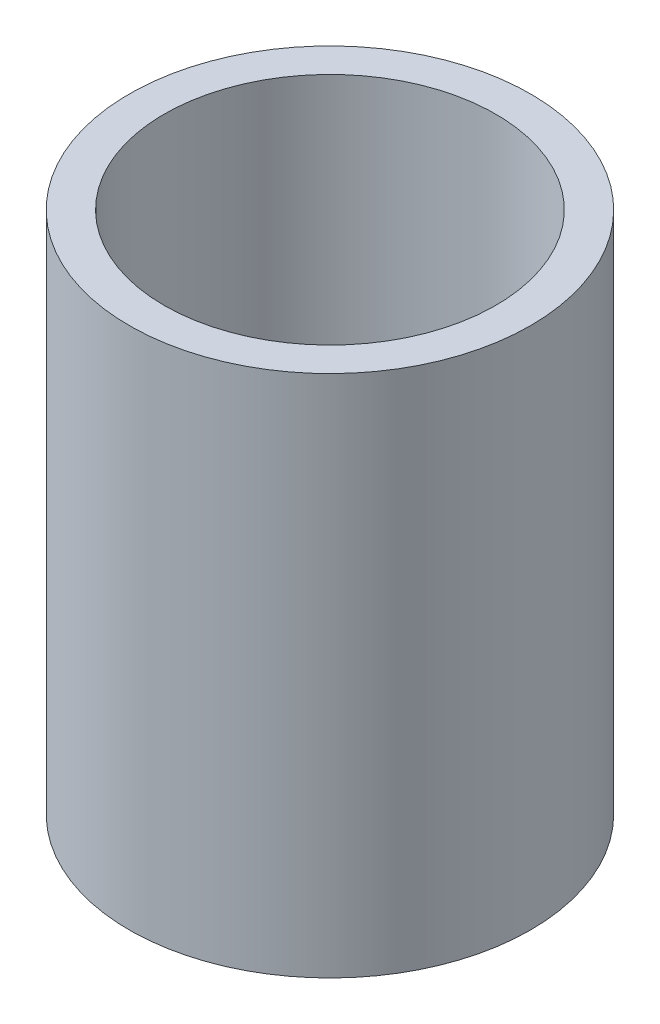
ISO-10303-21;
HEADER;
FILE_DESCRIPTION(('STEP AP214'),'2;1');
FILE_NAME('part.step','',(''),(''),'','','');
FILE_SCHEMA(('AUTOMOTIVE_DESIGN { 1 0 10303 214 1 1 1 1 }'));
ENDSEC;
DATA;
#1=APPLICATION_CONTEXT('core data for automotive mechanical design processes');
#2=APPLICATION_PROTOCOL_DEFINITION('international standard','automotive_design',2000,#1);
#3=PRODUCT_CONTEXT('',#1,'mechanical');
#4=PRODUCT('Part','Part','',(#3));
#5=PRODUCT_RELATED_PRODUCT_CATEGORY('part','',(#4));
#6=PRODUCT_DEFINITION_FORMATION('','',#4);
#7=PRODUCT_DEFINITION_CONTEXT('part definition',#1,'design');
#8=PRODUCT_DEFINITION('design','',#6,#7);
#9=PRODUCT_DEFINITION_SHAPE('','',#8);
#10=(LENGTH_UNIT() NAMED_UNIT(*) SI_UNIT(.MILLI.,.METRE.));
#11=(NAMED_UNIT(*) PLANE_ANGLE_UNIT() SI_UNIT($,.RADIAN.));
#12=(NAMED_UNIT(*) SI_UNIT($,.STERADIAN.) SOLID_ANGLE_UNIT());
#13=UNCERTAINTY_MEASURE_WITH_UNIT(LENGTH_MEASURE(1.E-05),#10,'distance_accuracy_value','');
#14=(GEOMETRIC_REPRESENTATION_CONTEXT(3) GLOBAL_UNCERTAINTY_ASSIGNED_CONTEXT((#13)) GLOBAL_UNIT_ASSIGNED_CONTEXT((#10,
#11,#12)) REPRESENTATION_CONTEXT('',''));
#15=CARTESIAN_POINT('',(0.,0.,0.));
#16=DIRECTION('',(0.,0.,1.));
#17=DIRECTION('',(1.,0.,0.));
#18=AXIS2_PLACEMENT_3D('',#15,#16,#17);
#19=CARTESIAN_POINT('',(0.,150.,0.));
#20=DIRECTION('',(0.,1.,0.));
#21=DIRECTION('',(0.,0.,1.));
#22=AXIS2_PLACEMENT_3D('',#19,#20,#21);
#23=PLANE('',#22);
#24=CARTESIAN_POINT('',(0.,150.,0.));
#25=DIRECTION('',(0.,1.,0.));
#26=DIRECTION('',(1.,0.,0.));
#27=AXIS2_PLACEMENT_3D('',#24,#25,#26);
#28=CIRCLE('',#27,57.5);
#29=CARTESIAN_POINT('',(57.5,150.,0.));
#30=VERTEX_POINT('',#29);
#31=EDGE_CURVE('E11',#30,#30,#28,.T.);
#32=ORIENTED_EDGE('',*,*,#31,.T.);
#33=EDGE_LOOP('',(#32));
#34=FACE_BOUND('',#33,.T.);
#35=CARTESIAN_POINT('',(0.,150.,0.));
#36=DIRECTION('',(0.,1.,0.));
#37=DIRECTION('',(0.,0.,1.));
#38=AXIS2_PLACEMENT_3D('',#35,#36,#37);
#39=CIRCLE('',#38,47.5);
#40=CARTESIAN_POINT('',(0.,150.,47.5));
#41=VERTEX_POINT('',#40);
#42=EDGE_CURVE('E51',#41,#41,#39,.T.);
#43=ORIENTED_EDGE('',*,*,#42,.F.);
#44=EDGE_LOOP('',(#43));
#45=FACE_BOUND('',#44,.T.);
#46=ADVANCED_FACE('F40',(#34,#45),#23,.T.);
#47=CARTESIAN_POINT('',(0.,0.,0.));
#48=DIRECTION('',(0.,1.,0.));
#49=DIRECTION('',(0.,0.,1.));
#50=AXIS2_PLACEMENT_3D('',#47,#48,#49);
#51=PLANE('',#50);
#52=CARTESIAN_POINT('',(0.,0.,0.));
#53=DIRECTION('',(0.,1.,0.));
#54=DIRECTION('',(1.,0.,0.));
#55=AXIS2_PLACEMENT_3D('',#52,#53,#54);
#56=CIRCLE('',#55,57.5);
#57=CARTESIAN_POINT('',(57.5,0.,0.));
#58=VERTEX_POINT('',#57);
#59=EDGE_CURVE('E44',#58,#58,#56,.T.);
#60=ORIENTED_EDGE('',*,*,#59,.F.);
#61=EDGE_LOOP('',(#60));
#62=FACE_BOUND('',#61,.T.);
#63=CARTESIAN_POINT('',(0.,0.,0.));
#64=DIRECTION('',(0.,1.,0.));
#65=DIRECTION('',(0.,0.,1.));
#66=AXIS2_PLACEMENT_3D('',#63,#64,#65);
#67=CIRCLE('',#66,47.5);
#68=CARTESIAN_POINT('',(0.,0.,47.5));
#69=VERTEX_POINT('',#68);
#70=EDGE_CURVE('E53',#69,#69,#67,.T.);
#71=ORIENTED_EDGE('',*,*,#70,.T.);
#72=EDGE_LOOP('',(#71));
#73=FACE_BOUND('',#72,.T.);
#74=ADVANCED_FACE('F63',(#62,#73),#51,.F.);
#75=CARTESIAN_POINT('',(0.,150.,0.));
#76=DIRECTION('',(0.,-1.,0.));
#77=DIRECTION('',(0.,0.,-1.));
#78=AXIS2_PLACEMENT_3D('',#75,#76,#77);
#79=CYLINDRICAL_SURFACE('',#78,57.5);
#80=ORIENTED_EDGE('',*,*,#31,.F.);
#81=EDGE_LOOP('',(#80));
#82=FACE_BOUND('',#81,.T.);
#83=ORIENTED_EDGE('',*,*,#59,.T.);
#84=EDGE_LOOP('',(#83));
#85=FACE_BOUND('',#84,.T.);
#86=ADVANCED_FACE('F42',(#82,#85),#79,.T.);
#87=CARTESIAN_POINT('',(0.,150.,0.));
#88=DIRECTION('',(0.,-1.,0.));
#89=DIRECTION('',(0.,0.,-1.));
#90=AXIS2_PLACEMENT_3D('',#87,#88,#89);
#91=CYLINDRICAL_SURFACE('',#90,47.5);
#92=ORIENTED_EDGE('',*,*,#42,.T.);
#93=EDGE_LOOP('',(#92));
#94=FACE_BOUND('',#93,.T.);
#95=ORIENTED_EDGE('',*,*,#70,.F.);
#96=EDGE_LOOP('',(#95));
#97=FACE_BOUND('',#96,.T.);
#98=ADVANCED_FACE('F59',(#94,#97),#91,.F.);
#99=CLOSED_SHELL('',(#46,#74,#86,#98));
#100=MANIFOLD_SOLID_BREP('B2',#99);
#101=ADVANCED_BREP_SHAPE_REPRESENTATION('',(#18,#100),#14);
#102=SHAPE_DEFINITION_REPRESENTATION(#9,#101);
ENDSEC;
END-ISO-10303-21;
